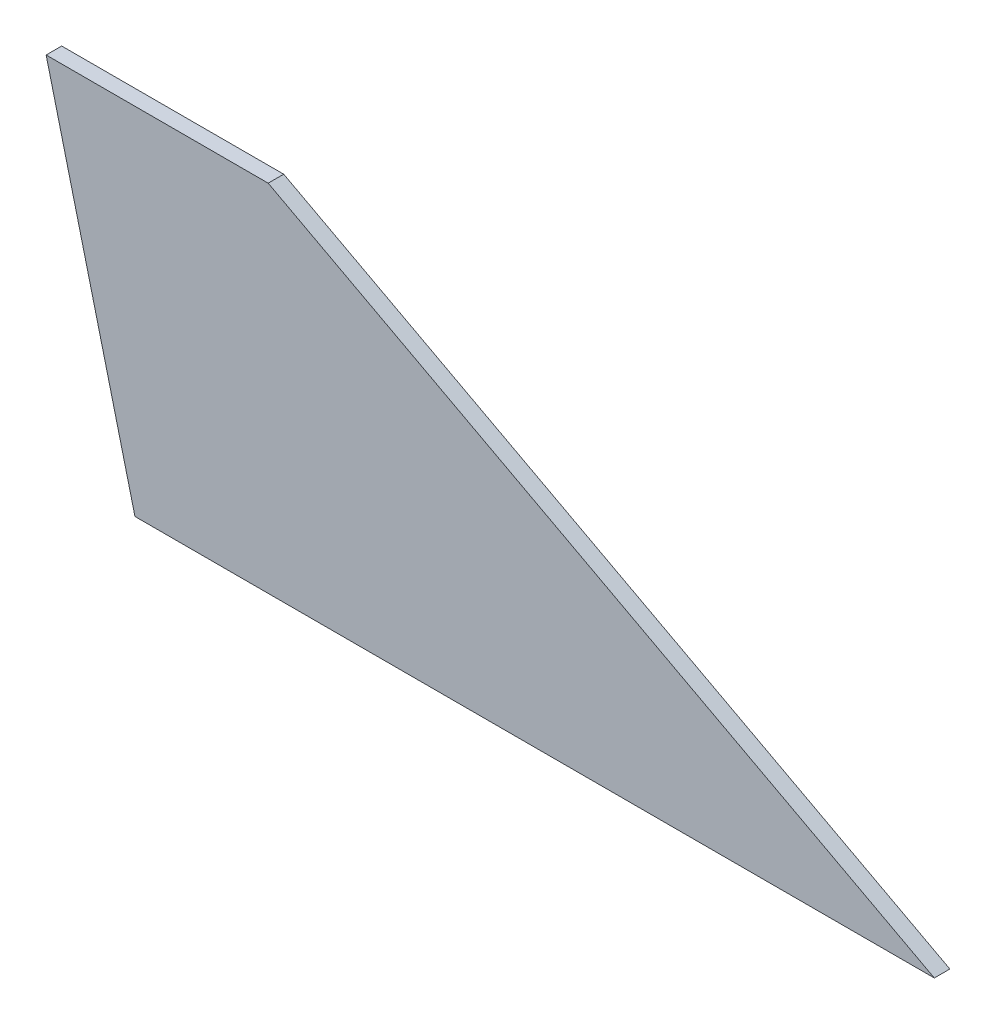
ISO-10303-21;
HEADER;
FILE_DESCRIPTION(('STEP AP214'),'2;1');
FILE_NAME('part.step','',(''),(''),'','','');
FILE_SCHEMA(('AUTOMOTIVE_DESIGN { 1 0 10303 214 1 1 1 1 }'));
ENDSEC;
DATA;
#1=APPLICATION_CONTEXT('core data for automotive mechanical design processes');
#2=APPLICATION_PROTOCOL_DEFINITION('international standard','automotive_design',2000,#1);
#3=PRODUCT_CONTEXT('',#1,'mechanical');
#4=PRODUCT('Part','Part','',(#3));
#5=PRODUCT_RELATED_PRODUCT_CATEGORY('part','',(#4));
#6=PRODUCT_DEFINITION_FORMATION('','',#4);
#7=PRODUCT_DEFINITION_CONTEXT('part definition',#1,'design');
#8=PRODUCT_DEFINITION('design','',#6,#7);
#9=PRODUCT_DEFINITION_SHAPE('','',#8);
#10=(LENGTH_UNIT() NAMED_UNIT(*) SI_UNIT(.MILLI.,.METRE.));
#11=(NAMED_UNIT(*) PLANE_ANGLE_UNIT() SI_UNIT($,.RADIAN.));
#12=(NAMED_UNIT(*) SI_UNIT($,.STERADIAN.) SOLID_ANGLE_UNIT());
#13=UNCERTAINTY_MEASURE_WITH_UNIT(LENGTH_MEASURE(1.E-05),#10,'distance_accuracy_value','');
#14=(GEOMETRIC_REPRESENTATION_CONTEXT(3) GLOBAL_UNCERTAINTY_ASSIGNED_CONTEXT((#13)) GLOBAL_UNIT_ASSIGNED_CONTEXT((#10,
#11,#12)) REPRESENTATION_CONTEXT('',''));
#15=CARTESIAN_POINT('',(0.,0.,0.));
#16=DIRECTION('',(0.,0.,1.));
#17=DIRECTION('',(1.,0.,0.));
#18=AXIS2_PLACEMENT_3D('',#15,#16,#17);
#19=CARTESIAN_POINT('',(-50.8,203.2,8.89));
#20=DIRECTION('',(0.970142500145332,0.242535625036333,0.));
#21=DIRECTION('',(-0.242535625036333,0.970142500145332,0.));
#22=AXIS2_PLACEMENT_3D('',#19,#20,#21);
#23=PLANE('',#22);
#24=DIRECTION('',(0.242535625036333,-0.970142500145332,0.));
#25=VECTOR('',#24,1.);
#26=CARTESIAN_POINT('',(-50.8,203.2,0.));
#27=LINE('',#26,#25);
#28=CARTESIAN_POINT('',(-50.8,203.2,0.));
#29=VERTEX_POINT('',#28);
#30=CARTESIAN_POINT('',(0.,0.,0.));
#31=VERTEX_POINT('',#30);
#32=EDGE_CURVE('E107',#29,#31,#27,.T.);
#33=ORIENTED_EDGE('',*,*,#32,.T.);
#34=DIRECTION('',(0.,0.,-1.));
#35=VECTOR('',#34,1.);
#36=CARTESIAN_POINT('',(0.,0.,8.89));
#37=LINE('',#36,#35);
#38=CARTESIAN_POINT('',(0.,0.,8.89));
#39=VERTEX_POINT('',#38);
#40=EDGE_CURVE('E11',#39,#31,#37,.T.);
#41=ORIENTED_EDGE('',*,*,#40,.F.);
#42=DIRECTION('',(0.242535625036333,-0.970142500145332,0.));
#43=VECTOR('',#42,1.);
#44=CARTESIAN_POINT('',(-50.8,203.2,8.89));
#45=LINE('',#44,#43);
#46=CARTESIAN_POINT('',(-50.8,203.2,8.89));
#47=VERTEX_POINT('',#46);
#48=EDGE_CURVE('E91',#47,#39,#45,.T.);
#49=ORIENTED_EDGE('',*,*,#48,.F.);
#50=DIRECTION('',(0.,0.,-1.));
#51=VECTOR('',#50,1.);
#52=CARTESIAN_POINT('',(-50.8,203.2,8.89));
#53=LINE('',#52,#51);
#54=EDGE_CURVE('E103',#47,#29,#53,.T.);
#55=ORIENTED_EDGE('',*,*,#54,.T.);
#56=EDGE_LOOP('',(#33,#41,#49,#55));
#57=FACE_BOUND('',#56,.T.);
#58=ADVANCED_FACE('F39',(#57),#23,.F.);
#59=CARTESIAN_POINT('',(0.,0.,8.89));
#60=DIRECTION('',(0.,1.,0.));
#61=DIRECTION('',(0.,0.,1.));
#62=AXIS2_PLACEMENT_3D('',#59,#60,#61);
#63=PLANE('',#62);
#64=DIRECTION('',(1.,0.,0.));
#65=VECTOR('',#64,1.);
#66=CARTESIAN_POINT('',(0.,0.,0.));
#67=LINE('',#66,#65);
#68=CARTESIAN_POINT('',(457.2,0.,0.));
#69=VERTEX_POINT('',#68);
#70=EDGE_CURVE('E96',#31,#69,#67,.T.);
#71=ORIENTED_EDGE('',*,*,#70,.T.);
#72=DIRECTION('',(0.,0.,-1.));
#73=VECTOR('',#72,1.);
#74=CARTESIAN_POINT('',(457.2,0.,8.89));
#75=LINE('',#74,#73);
#76=CARTESIAN_POINT('',(457.2,0.,8.89));
#77=VERTEX_POINT('',#76);
#78=EDGE_CURVE('E48',#77,#69,#75,.T.);
#79=ORIENTED_EDGE('',*,*,#78,.F.);
#80=DIRECTION('',(1.,0.,0.));
#81=VECTOR('',#80,1.);
#82=CARTESIAN_POINT('',(0.,0.,8.89));
#83=LINE('',#82,#81);
#84=EDGE_CURVE('E86',#39,#77,#83,.T.);
#85=ORIENTED_EDGE('',*,*,#84,.F.);
#86=ORIENTED_EDGE('',*,*,#40,.T.);
#87=EDGE_LOOP('',(#71,#79,#85,#86));
#88=FACE_BOUND('',#87,.T.);
#89=ADVANCED_FACE('F95',(#88),#63,.F.);
#90=CARTESIAN_POINT('',(457.2,0.,8.89));
#91=DIRECTION('',(-0.470588235294118,-0.882352941176471,0.));
#92=DIRECTION('',(0.882352941176471,-0.470588235294118,0.));
#93=AXIS2_PLACEMENT_3D('',#90,#91,#92);
#94=PLANE('',#93);
#95=DIRECTION('',(-0.882352941176471,0.470588235294118,0.));
#96=VECTOR('',#95,1.);
#97=CARTESIAN_POINT('',(457.2,0.,0.));
#98=LINE('',#97,#96);
#99=CARTESIAN_POINT('',(76.2,203.2,0.));
#100=VERTEX_POINT('',#99);
#101=EDGE_CURVE('E73',#69,#100,#98,.T.);
#102=ORIENTED_EDGE('',*,*,#101,.T.);
#103=DIRECTION('',(0.,0.,-1.));
#104=VECTOR('',#103,1.);
#105=CARTESIAN_POINT('',(76.2,203.2,8.89));
#106=LINE('',#105,#104);
#107=CARTESIAN_POINT('',(76.2,203.2,8.89));
#108=VERTEX_POINT('',#107);
#109=EDGE_CURVE('E98',#108,#100,#106,.T.);
#110=ORIENTED_EDGE('',*,*,#109,.F.);
#111=DIRECTION('',(-0.882352941176471,0.470588235294118,0.));
#112=VECTOR('',#111,1.);
#113=CARTESIAN_POINT('',(457.2,0.,8.89));
#114=LINE('',#113,#112);
#115=EDGE_CURVE('E89',#77,#108,#114,.T.);
#116=ORIENTED_EDGE('',*,*,#115,.F.);
#117=ORIENTED_EDGE('',*,*,#78,.T.);
#118=EDGE_LOOP('',(#102,#110,#116,#117));
#119=FACE_BOUND('',#118,.T.);
#120=ADVANCED_FACE('F99',(#119),#94,.F.);
#121=CARTESIAN_POINT('',(76.2,203.2,8.89));
#122=DIRECTION('',(0.,-1.,0.));
#123=DIRECTION('',(0.,0.,-1.));
#124=AXIS2_PLACEMENT_3D('',#121,#122,#123);
#125=PLANE('',#124);
#126=DIRECTION('',(-1.,0.,0.));
#127=VECTOR('',#126,1.);
#128=CARTESIAN_POINT('',(76.2,203.2,0.));
#129=LINE('',#128,#127);
#130=EDGE_CURVE('E79',#100,#29,#129,.T.);
#131=ORIENTED_EDGE('',*,*,#130,.T.);
#132=ORIENTED_EDGE('',*,*,#54,.F.);
#133=DIRECTION('',(-1.,0.,0.));
#134=VECTOR('',#133,1.);
#135=CARTESIAN_POINT('',(76.2,203.2,8.89));
#136=LINE('',#135,#134);
#137=EDGE_CURVE('E56',#108,#47,#136,.T.);
#138=ORIENTED_EDGE('',*,*,#137,.F.);
#139=ORIENTED_EDGE('',*,*,#109,.T.);
#140=EDGE_LOOP('',(#131,#132,#138,#139));
#141=FACE_BOUND('',#140,.T.);
#142=ADVANCED_FACE('F120',(#141),#125,.F.);
#143=CARTESIAN_POINT('',(0.,0.,8.89));
#144=DIRECTION('',(0.,0.,1.));
#145=DIRECTION('',(1.,0.,0.));
#146=AXIS2_PLACEMENT_3D('',#143,#144,#145);
#147=PLANE('',#146);
#148=ORIENTED_EDGE('',*,*,#48,.T.);
#149=ORIENTED_EDGE('',*,*,#84,.T.);
#150=ORIENTED_EDGE('',*,*,#115,.T.);
#151=ORIENTED_EDGE('',*,*,#137,.T.);
#152=EDGE_LOOP('',(#148,#149,#150,#151));
#153=FACE_BOUND('',#152,.T.);
#154=ADVANCED_FACE('F87',(#153),#147,.T.);
#155=CARTESIAN_POINT('',(0.,0.,0.));
#156=DIRECTION('',(0.,0.,1.));
#157=DIRECTION('',(1.,0.,0.));
#158=AXIS2_PLACEMENT_3D('',#155,#156,#157);
#159=PLANE('',#158);
#160=ORIENTED_EDGE('',*,*,#32,.F.);
#161=ORIENTED_EDGE('',*,*,#130,.F.);
#162=ORIENTED_EDGE('',*,*,#101,.F.);
#163=ORIENTED_EDGE('',*,*,#70,.F.);
#164=EDGE_LOOP('',(#160,#161,#162,#163));
#165=FACE_BOUND('',#164,.T.);
#166=ADVANCED_FACE('F123',(#165),#159,.F.);
#167=CLOSED_SHELL('',(#58,#89,#120,#142,#154,#166));
#168=MANIFOLD_SOLID_BREP('B2',#167);
#169=ADVANCED_BREP_SHAPE_REPRESENTATION('',(#18,#168),#14);
#170=SHAPE_DEFINITION_REPRESENTATION(#9,#169);
ENDSEC;
END-ISO-10303-21;
